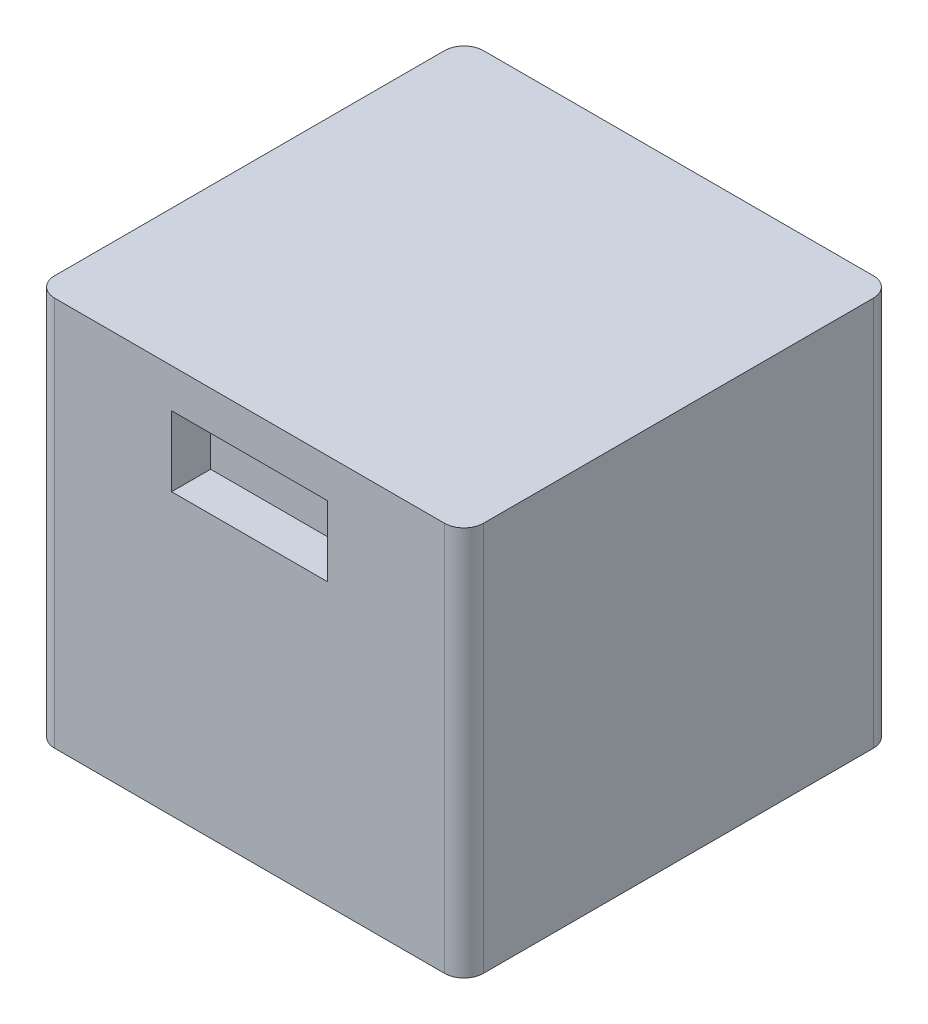
ISO-10303-21;
HEADER;
FILE_DESCRIPTION(('STEP AP214'),'2;1');
FILE_NAME('part.step','',(''),(''),'','','');
FILE_SCHEMA(('AUTOMOTIVE_DESIGN { 1 0 10303 214 1 1 1 1 }'));
ENDSEC;
DATA;
#1=APPLICATION_CONTEXT('core data for automotive mechanical design processes');
#2=APPLICATION_PROTOCOL_DEFINITION('international standard','automotive_design',2000,#1);
#3=PRODUCT_CONTEXT('',#1,'mechanical');
#4=PRODUCT('Part','Part','',(#3));
#5=PRODUCT_RELATED_PRODUCT_CATEGORY('part','',(#4));
#6=PRODUCT_DEFINITION_FORMATION('','',#4);
#7=PRODUCT_DEFINITION_CONTEXT('part definition',#1,'design');
#8=PRODUCT_DEFINITION('design','',#6,#7);
#9=PRODUCT_DEFINITION_SHAPE('','',#8);
#10=(LENGTH_UNIT() NAMED_UNIT(*) SI_UNIT(.MILLI.,.METRE.));
#11=(NAMED_UNIT(*) PLANE_ANGLE_UNIT() SI_UNIT($,.RADIAN.));
#12=(NAMED_UNIT(*) SI_UNIT($,.STERADIAN.) SOLID_ANGLE_UNIT());
#13=UNCERTAINTY_MEASURE_WITH_UNIT(LENGTH_MEASURE(1.E-05),#10,'distance_accuracy_value','');
#14=(GEOMETRIC_REPRESENTATION_CONTEXT(3) GLOBAL_UNCERTAINTY_ASSIGNED_CONTEXT((#13)) GLOBAL_UNIT_ASSIGNED_CONTEXT((#10,
#11,#12)) REPRESENTATION_CONTEXT('',''));
#15=CARTESIAN_POINT('',(0.,0.,0.));
#16=DIRECTION('',(0.,0.,1.));
#17=DIRECTION('',(1.,0.,0.));
#18=AXIS2_PLACEMENT_3D('',#15,#16,#17);
#19=CARTESIAN_POINT('',(110.,200.,-110.));
#20=DIRECTION('',(-1.,0.,0.));
#21=DIRECTION('',(0.,0.,1.));
#22=AXIS2_PLACEMENT_3D('',#19,#20,#21);
#23=PLANE('',#22);
#24=DIRECTION('',(0.,0.,-1.));
#25=VECTOR('',#24,1.);
#26=CARTESIAN_POINT('',(110.,0.,-110.));
#27=LINE('',#26,#25);
#28=CARTESIAN_POINT('',(110.,0.,100.));
#29=VERTEX_POINT('',#28);
#30=CARTESIAN_POINT('',(110.,0.,-100.));
#31=VERTEX_POINT('',#30);
#32=EDGE_CURVE('E255',#29,#31,#27,.T.);
#33=ORIENTED_EDGE('',*,*,#32,.T.);
#34=DIRECTION('',(0.,-1.,0.));
#35=VECTOR('',#34,1.);
#36=CARTESIAN_POINT('',(110.,200.,-100.));
#37=LINE('',#36,#35);
#38=CARTESIAN_POINT('',(110.,200.,-100.));
#39=VERTEX_POINT('',#38);
#40=EDGE_CURVE('E340',#31,#39,#37,.F.);
#41=ORIENTED_EDGE('',*,*,#40,.T.);
#42=DIRECTION('',(0.,0.,-1.));
#43=VECTOR('',#42,1.);
#44=CARTESIAN_POINT('',(110.,200.,-110.));
#45=LINE('',#44,#43);
#46=CARTESIAN_POINT('',(110.,200.,100.));
#47=VERTEX_POINT('',#46);
#48=EDGE_CURVE('E267',#47,#39,#45,.T.);
#49=ORIENTED_EDGE('',*,*,#48,.F.);
#50=DIRECTION('',(0.,-1.,0.));
#51=VECTOR('',#50,1.);
#52=CARTESIAN_POINT('',(110.,200.,100.));
#53=LINE('',#52,#51);
#54=EDGE_CURVE('E336',#47,#29,#53,.T.);
#55=ORIENTED_EDGE('',*,*,#54,.T.);
#56=EDGE_LOOP('',(#33,#41,#49,#55));
#57=FACE_BOUND('',#56,.T.);
#58=ADVANCED_FACE('F45',(#57),#23,.F.);
#59=CARTESIAN_POINT('',(-110.,200.,-110.));
#60=DIRECTION('',(0.,0.,1.));
#61=DIRECTION('',(1.,0.,0.));
#62=AXIS2_PLACEMENT_3D('',#59,#60,#61);
#63=PLANE('',#62);
#64=DIRECTION('',(-1.,0.,0.));
#65=VECTOR('',#64,1.);
#66=CARTESIAN_POINT('',(-110.,0.,-110.));
#67=LINE('',#66,#65);
#68=CARTESIAN_POINT('',(100.,0.,-110.));
#69=VERTEX_POINT('',#68);
#70=CARTESIAN_POINT('',(-100.,0.,-110.));
#71=VERTEX_POINT('',#70);
#72=EDGE_CURVE('E288',#69,#71,#67,.T.);
#73=ORIENTED_EDGE('',*,*,#72,.T.);
#74=DIRECTION('',(0.,-1.,0.));
#75=VECTOR('',#74,1.);
#76=CARTESIAN_POINT('',(-100.,200.,-110.));
#77=LINE('',#76,#75);
#78=CARTESIAN_POINT('',(-100.,200.,-110.));
#79=VERTEX_POINT('',#78);
#80=EDGE_CURVE('E321',#71,#79,#77,.F.);
#81=ORIENTED_EDGE('',*,*,#80,.T.);
#82=DIRECTION('',(-1.,0.,0.));
#83=VECTOR('',#82,1.);
#84=CARTESIAN_POINT('',(-110.,200.,-110.));
#85=LINE('',#84,#83);
#86=CARTESIAN_POINT('',(100.,200.,-110.));
#87=VERTEX_POINT('',#86);
#88=EDGE_CURVE('E271',#87,#79,#85,.T.);
#89=ORIENTED_EDGE('',*,*,#88,.F.);
#90=DIRECTION('',(0.,-1.,0.));
#91=VECTOR('',#90,1.);
#92=CARTESIAN_POINT('',(100.,200.,-110.));
#93=LINE('',#92,#91);
#94=EDGE_CURVE('E317',#87,#69,#93,.T.);
#95=ORIENTED_EDGE('',*,*,#94,.T.);
#96=EDGE_LOOP('',(#73,#81,#89,#95));
#97=FACE_BOUND('',#96,.T.);
#98=ADVANCED_FACE('F372',(#97),#63,.F.);
#99=CARTESIAN_POINT('',(-110.,200.,-110.));
#100=DIRECTION('',(1.,0.,0.));
#101=DIRECTION('',(0.,0.,-1.));
#102=AXIS2_PLACEMENT_3D('',#99,#100,#101);
#103=PLANE('',#102);
#104=DIRECTION('',(0.,0.,1.));
#105=VECTOR('',#104,1.);
#106=CARTESIAN_POINT('',(-110.,200.,-110.));
#107=LINE('',#106,#105);
#108=CARTESIAN_POINT('',(-110.,200.,-100.));
#109=VERTEX_POINT('',#108);
#110=CARTESIAN_POINT('',(-110.,200.,100.));
#111=VERTEX_POINT('',#110);
#112=EDGE_CURVE('E276',#109,#111,#107,.T.);
#113=ORIENTED_EDGE('',*,*,#112,.F.);
#114=DIRECTION('',(0.,-1.,0.));
#115=VECTOR('',#114,1.);
#116=CARTESIAN_POINT('',(-110.,200.,-100.));
#117=LINE('',#116,#115);
#118=CARTESIAN_POINT('',(-110.,0.,-100.));
#119=VERTEX_POINT('',#118);
#120=EDGE_CURVE('E301',#109,#119,#117,.T.);
#121=ORIENTED_EDGE('',*,*,#120,.T.);
#122=DIRECTION('',(0.,0.,1.));
#123=VECTOR('',#122,1.);
#124=CARTESIAN_POINT('',(-110.,0.,-110.));
#125=LINE('',#124,#123);
#126=CARTESIAN_POINT('',(-110.,0.,100.));
#127=VERTEX_POINT('',#126);
#128=EDGE_CURVE('E292',#119,#127,#125,.T.);
#129=ORIENTED_EDGE('',*,*,#128,.T.);
#130=DIRECTION('',(0.,-1.,0.));
#131=VECTOR('',#130,1.);
#132=CARTESIAN_POINT('',(-110.,200.,100.));
#133=LINE('',#132,#131);
#134=EDGE_CURVE('E284',#127,#111,#133,.F.);
#135=ORIENTED_EDGE('',*,*,#134,.T.);
#136=EDGE_LOOP('',(#113,#121,#129,#135));
#137=FACE_BOUND('',#136,.T.);
#138=ADVANCED_FACE('F380',(#137),#103,.F.);
#139=CARTESIAN_POINT('',(-110.,200.,110.));
#140=DIRECTION('',(0.,0.,-1.));
#141=DIRECTION('',(-1.,0.,0.));
#142=AXIS2_PLACEMENT_3D('',#139,#140,#141);
#143=PLANE('',#142);
#144=DIRECTION('',(-1.,0.,0.));
#145=VECTOR('',#144,1.);
#146=CARTESIAN_POINT('',(-40.,180.,110.));
#147=LINE('',#146,#145);
#148=CARTESIAN_POINT('',(40.,180.,110.));
#149=VERTEX_POINT('',#148);
#150=CARTESIAN_POINT('',(-40.,180.,110.));
#151=VERTEX_POINT('',#150);
#152=EDGE_CURVE('E228',#149,#151,#147,.T.);
#153=ORIENTED_EDGE('',*,*,#152,.F.);
#154=DIRECTION('',(0.,1.,0.));
#155=VECTOR('',#154,1.);
#156=CARTESIAN_POINT('',(40.,180.,110.));
#157=LINE('',#156,#155);
#158=CARTESIAN_POINT('',(40.,144.,110.));
#159=VERTEX_POINT('',#158);
#160=EDGE_CURVE('E69',#159,#149,#157,.T.);
#161=ORIENTED_EDGE('',*,*,#160,.F.);
#162=DIRECTION('',(1.,0.,0.));
#163=VECTOR('',#162,1.);
#164=CARTESIAN_POINT('',(-40.,144.,110.));
#165=LINE('',#164,#163);
#166=CARTESIAN_POINT('',(-40.,144.,110.));
#167=VERTEX_POINT('',#166);
#168=EDGE_CURVE('E213',#167,#159,#165,.T.);
#169=ORIENTED_EDGE('',*,*,#168,.F.);
#170=DIRECTION('',(0.,-1.,0.));
#171=VECTOR('',#170,1.);
#172=CARTESIAN_POINT('',(-40.,180.,110.));
#173=LINE('',#172,#171);
#174=EDGE_CURVE('E232',#151,#167,#173,.T.);
#175=ORIENTED_EDGE('',*,*,#174,.F.);
#176=EDGE_LOOP('',(#153,#161,#169,#175));
#177=FACE_BOUND('',#176,.T.);
#178=DIRECTION('',(1.,0.,0.));
#179=VECTOR('',#178,1.);
#180=CARTESIAN_POINT('',(-110.,0.,110.));
#181=LINE('',#180,#179);
#182=CARTESIAN_POINT('',(-100.,0.,110.));
#183=VERTEX_POINT('',#182);
#184=CARTESIAN_POINT('',(100.,0.,110.));
#185=VERTEX_POINT('',#184);
#186=EDGE_CURVE('E272',#183,#185,#181,.T.);
#187=ORIENTED_EDGE('',*,*,#186,.T.);
#188=DIRECTION('',(0.,-1.,0.));
#189=VECTOR('',#188,1.);
#190=CARTESIAN_POINT('',(100.,200.,110.));
#191=LINE('',#190,#189);
#192=CARTESIAN_POINT('',(100.,200.,110.));
#193=VERTEX_POINT('',#192);
#194=EDGE_CURVE('E11',#185,#193,#191,.F.);
#195=ORIENTED_EDGE('',*,*,#194,.T.);
#196=DIRECTION('',(1.,0.,0.));
#197=VECTOR('',#196,1.);
#198=CARTESIAN_POINT('',(-110.,200.,110.));
#199=LINE('',#198,#197);
#200=CARTESIAN_POINT('',(-100.,200.,110.));
#201=VERTEX_POINT('',#200);
#202=EDGE_CURVE('E280',#201,#193,#199,.T.);
#203=ORIENTED_EDGE('',*,*,#202,.F.);
#204=DIRECTION('',(0.,-1.,0.));
#205=VECTOR('',#204,1.);
#206=CARTESIAN_POINT('',(-100.,200.,110.));
#207=LINE('',#206,#205);
#208=EDGE_CURVE('E54',#201,#183,#207,.T.);
#209=ORIENTED_EDGE('',*,*,#208,.T.);
#210=EDGE_LOOP('',(#187,#195,#203,#209));
#211=FACE_BOUND('',#210,.T.);
#212=ADVANCED_FACE('F348',(#177,#211),#143,.F.);
#213=CARTESIAN_POINT('',(0.,200.,0.));
#214=DIRECTION('',(0.,1.,0.));
#215=DIRECTION('',(0.,0.,1.));
#216=AXIS2_PLACEMENT_3D('',#213,#214,#215);
#217=PLANE('',#216);
#218=ORIENTED_EDGE('',*,*,#88,.T.);
#219=CARTESIAN_POINT('',(-100.,200.,-100.));
#220=DIRECTION('',(0.,1.,0.));
#221=DIRECTION('',(0.,0.,1.));
#222=AXIS2_PLACEMENT_3D('',#219,#220,#221);
#223=CIRCLE('',#222,10.);
#224=EDGE_CURVE('E333',#79,#109,#223,.T.);
#225=ORIENTED_EDGE('',*,*,#224,.T.);
#226=ORIENTED_EDGE('',*,*,#112,.T.);
#227=CARTESIAN_POINT('',(-100.,200.,100.));
#228=DIRECTION('',(0.,1.,0.));
#229=DIRECTION('',(0.,0.,1.));
#230=AXIS2_PLACEMENT_3D('',#227,#228,#229);
#231=CIRCLE('',#230,10.);
#232=EDGE_CURVE('E324',#111,#201,#231,.T.);
#233=ORIENTED_EDGE('',*,*,#232,.T.);
#234=ORIENTED_EDGE('',*,*,#202,.T.);
#235=CARTESIAN_POINT('',(100.,200.,100.));
#236=DIRECTION('',(0.,1.,0.));
#237=DIRECTION('',(0.,0.,1.));
#238=AXIS2_PLACEMENT_3D('',#235,#236,#237);
#239=CIRCLE('',#238,10.);
#240=EDGE_CURVE('E327',#193,#47,#239,.T.);
#241=ORIENTED_EDGE('',*,*,#240,.T.);
#242=ORIENTED_EDGE('',*,*,#48,.T.);
#243=CARTESIAN_POINT('',(100.,200.,-100.));
#244=DIRECTION('',(0.,1.,0.));
#245=DIRECTION('',(0.,0.,1.));
#246=AXIS2_PLACEMENT_3D('',#243,#244,#245);
#247=CIRCLE('',#246,10.);
#248=EDGE_CURVE('E330',#39,#87,#247,.T.);
#249=ORIENTED_EDGE('',*,*,#248,.T.);
#250=EDGE_LOOP('',(#218,#225,#226,#233,#234,#241,#242,#249));
#251=FACE_BOUND('',#250,.T.);
#252=ADVANCED_FACE('F365',(#251),#217,.T.);
#253=CARTESIAN_POINT('',(0.,0.,0.));
#254=DIRECTION('',(0.,1.,0.));
#255=DIRECTION('',(0.,0.,1.));
#256=AXIS2_PLACEMENT_3D('',#253,#254,#255);
#257=PLANE('',#256);
#258=CARTESIAN_POINT('',(0.,0.,-50.));
#259=DIRECTION('',(0.,-1.,0.));
#260=DIRECTION('',(0.,0.,-1.));
#261=AXIS2_PLACEMENT_3D('',#258,#259,#260);
#262=CIRCLE('',#261,30.);
#263=CARTESIAN_POINT('',(0.,0.,-80.));
#264=VERTEX_POINT('',#263);
#265=EDGE_CURVE('E256',#264,#264,#262,.T.);
#266=ORIENTED_EDGE('',*,*,#265,.F.);
#267=EDGE_LOOP('',(#266));
#268=FACE_BOUND('',#267,.T.);
#269=CARTESIAN_POINT('',(0.,0.,60.));
#270=DIRECTION('',(0.,-1.,0.));
#271=DIRECTION('',(0.,0.,-1.));
#272=AXIS2_PLACEMENT_3D('',#269,#270,#271);
#273=CIRCLE('',#272,30.);
#274=CARTESIAN_POINT('',(0.,0.,30.));
#275=VERTEX_POINT('',#274);
#276=EDGE_CURVE('E260',#275,#275,#273,.T.);
#277=ORIENTED_EDGE('',*,*,#276,.F.);
#278=EDGE_LOOP('',(#277));
#279=FACE_BOUND('',#278,.T.);
#280=ORIENTED_EDGE('',*,*,#128,.F.);
#281=CARTESIAN_POINT('',(-100.,0.,-100.));
#282=DIRECTION('',(0.,1.,0.));
#283=DIRECTION('',(0.,0.,1.));
#284=AXIS2_PLACEMENT_3D('',#281,#282,#283);
#285=CIRCLE('',#284,10.);
#286=EDGE_CURVE('E314',#119,#71,#285,.F.);
#287=ORIENTED_EDGE('',*,*,#286,.T.);
#288=ORIENTED_EDGE('',*,*,#72,.F.);
#289=CARTESIAN_POINT('',(100.,0.,-100.));
#290=DIRECTION('',(0.,1.,0.));
#291=DIRECTION('',(0.,0.,1.));
#292=AXIS2_PLACEMENT_3D('',#289,#290,#291);
#293=CIRCLE('',#292,10.);
#294=EDGE_CURVE('E311',#69,#31,#293,.F.);
#295=ORIENTED_EDGE('',*,*,#294,.T.);
#296=ORIENTED_EDGE('',*,*,#32,.F.);
#297=CARTESIAN_POINT('',(100.,0.,100.));
#298=DIRECTION('',(0.,1.,0.));
#299=DIRECTION('',(0.,0.,1.));
#300=AXIS2_PLACEMENT_3D('',#297,#298,#299);
#301=CIRCLE('',#300,10.);
#302=EDGE_CURVE('E308',#29,#185,#301,.F.);
#303=ORIENTED_EDGE('',*,*,#302,.T.);
#304=ORIENTED_EDGE('',*,*,#186,.F.);
#305=CARTESIAN_POINT('',(-100.,0.,100.));
#306=DIRECTION('',(0.,1.,0.));
#307=DIRECTION('',(0.,0.,1.));
#308=AXIS2_PLACEMENT_3D('',#305,#306,#307);
#309=CIRCLE('',#308,10.);
#310=EDGE_CURVE('E305',#183,#127,#309,.F.);
#311=ORIENTED_EDGE('',*,*,#310,.T.);
#312=EDGE_LOOP('',(#280,#287,#288,#295,#296,#303,#304,#311));
#313=FACE_BOUND('',#312,.T.);
#314=ADVANCED_FACE('F354',(#268,#279,#313),#257,.F.);
#315=CARTESIAN_POINT('',(-100.,200.,-100.));
#316=DIRECTION('',(0.,-1.,0.));
#317=DIRECTION('',(0.,0.,-1.));
#318=AXIS2_PLACEMENT_3D('',#315,#316,#317);
#319=CYLINDRICAL_SURFACE('',#318,10.);
#320=ORIENTED_EDGE('',*,*,#224,.F.);
#321=ORIENTED_EDGE('',*,*,#80,.F.);
#322=ORIENTED_EDGE('',*,*,#286,.F.);
#323=ORIENTED_EDGE('',*,*,#120,.F.);
#324=EDGE_LOOP('',(#320,#321,#322,#323));
#325=FACE_BOUND('',#324,.T.);
#326=ADVANCED_FACE('F377',(#325),#319,.T.);
#327=CARTESIAN_POINT('',(100.,200.,-100.));
#328=DIRECTION('',(0.,-1.,0.));
#329=DIRECTION('',(0.,0.,-1.));
#330=AXIS2_PLACEMENT_3D('',#327,#328,#329);
#331=CYLINDRICAL_SURFACE('',#330,10.);
#332=ORIENTED_EDGE('',*,*,#248,.F.);
#333=ORIENTED_EDGE('',*,*,#40,.F.);
#334=ORIENTED_EDGE('',*,*,#294,.F.);
#335=ORIENTED_EDGE('',*,*,#94,.F.);
#336=EDGE_LOOP('',(#332,#333,#334,#335));
#337=FACE_BOUND('',#336,.T.);
#338=ADVANCED_FACE('F369',(#337),#331,.T.);
#339=CARTESIAN_POINT('',(100.,200.,100.));
#340=DIRECTION('',(0.,-1.,0.));
#341=DIRECTION('',(0.,0.,-1.));
#342=AXIS2_PLACEMENT_3D('',#339,#340,#341);
#343=CYLINDRICAL_SURFACE('',#342,10.);
#344=ORIENTED_EDGE('',*,*,#240,.F.);
#345=ORIENTED_EDGE('',*,*,#194,.F.);
#346=ORIENTED_EDGE('',*,*,#302,.F.);
#347=ORIENTED_EDGE('',*,*,#54,.F.);
#348=EDGE_LOOP('',(#344,#345,#346,#347));
#349=FACE_BOUND('',#348,.T.);
#350=ADVANCED_FACE('F359',(#349),#343,.T.);
#351=CARTESIAN_POINT('',(-100.,200.,100.));
#352=DIRECTION('',(0.,-1.,0.));
#353=DIRECTION('',(0.,0.,-1.));
#354=AXIS2_PLACEMENT_3D('',#351,#352,#353);
#355=CYLINDRICAL_SURFACE('',#354,10.);
#356=ORIENTED_EDGE('',*,*,#232,.F.);
#357=ORIENTED_EDGE('',*,*,#134,.F.);
#358=ORIENTED_EDGE('',*,*,#310,.F.);
#359=ORIENTED_EDGE('',*,*,#208,.F.);
#360=EDGE_LOOP('',(#356,#357,#358,#359));
#361=FACE_BOUND('',#360,.T.);
#362=ADVANCED_FACE('F47',(#361),#355,.T.);
#363=CARTESIAN_POINT('',(0.,20.,60.));
#364=DIRECTION('',(0.,-1.,0.));
#365=DIRECTION('',(0.,0.,-1.));
#366=AXIS2_PLACEMENT_3D('',#363,#364,#365);
#367=CYLINDRICAL_SURFACE('',#366,30.);
#368=CARTESIAN_POINT('',(0.,20.,60.));
#369=DIRECTION('',(0.,-1.,0.));
#370=DIRECTION('',(0.,0.,-1.));
#371=AXIS2_PLACEMENT_3D('',#368,#369,#370);
#372=CIRCLE('',#371,30.);
#373=CARTESIAN_POINT('',(0.,20.,30.));
#374=VERTEX_POINT('',#373);
#375=EDGE_CURVE('E242',#374,#374,#372,.T.);
#376=ORIENTED_EDGE('',*,*,#375,.F.);
#377=EDGE_LOOP('',(#376));
#378=FACE_BOUND('',#377,.T.);
#379=ORIENTED_EDGE('',*,*,#276,.T.);
#380=EDGE_LOOP('',(#379));
#381=FACE_BOUND('',#380,.T.);
#382=ADVANCED_FACE('F383',(#378,#381),#367,.F.);
#383=CARTESIAN_POINT('',(0.,20.,60.));
#384=DIRECTION('',(0.,-1.,0.));
#385=DIRECTION('',(0.,0.,-1.));
#386=AXIS2_PLACEMENT_3D('',#383,#384,#385);
#387=PLANE('',#386);
#388=ORIENTED_EDGE('',*,*,#375,.T.);
#389=EDGE_LOOP('',(#388));
#390=FACE_BOUND('',#389,.T.);
#391=ADVANCED_FACE('F388',(#390),#387,.T.);
#392=CARTESIAN_POINT('',(0.,20.,-50.));
#393=DIRECTION('',(0.,-1.,0.));
#394=DIRECTION('',(0.,0.,-1.));
#395=AXIS2_PLACEMENT_3D('',#392,#393,#394);
#396=CYLINDRICAL_SURFACE('',#395,30.);
#397=CARTESIAN_POINT('',(0.,20.,-50.));
#398=DIRECTION('',(0.,-1.,0.));
#399=DIRECTION('',(0.,0.,-1.));
#400=AXIS2_PLACEMENT_3D('',#397,#398,#399);
#401=CIRCLE('',#400,30.);
#402=CARTESIAN_POINT('',(0.,20.,-80.));
#403=VERTEX_POINT('',#402);
#404=EDGE_CURVE('E251',#403,#403,#401,.T.);
#405=ORIENTED_EDGE('',*,*,#404,.F.);
#406=EDGE_LOOP('',(#405));
#407=FACE_BOUND('',#406,.T.);
#408=ORIENTED_EDGE('',*,*,#265,.T.);
#409=EDGE_LOOP('',(#408));
#410=FACE_BOUND('',#409,.T.);
#411=ADVANCED_FACE('F445',(#407,#410),#396,.F.);
#412=CARTESIAN_POINT('',(0.,20.,-50.));
#413=DIRECTION('',(0.,-1.,0.));
#414=DIRECTION('',(0.,0.,-1.));
#415=AXIS2_PLACEMENT_3D('',#412,#413,#414);
#416=PLANE('',#415);
#417=ORIENTED_EDGE('',*,*,#404,.T.);
#418=EDGE_LOOP('',(#417));
#419=FACE_BOUND('',#418,.T.);
#420=ADVANCED_FACE('F456',(#419),#416,.T.);
#421=CARTESIAN_POINT('',(40.,180.,90.));
#422=DIRECTION('',(1.,0.,0.));
#423=DIRECTION('',(0.,1.,0.));
#424=AXIS2_PLACEMENT_3D('',#421,#422,#423);
#425=PLANE('',#424);
#426=DIRECTION('',(0.,0.,-1.));
#427=VECTOR('',#426,1.);
#428=CARTESIAN_POINT('',(40.,175.987181080042,93.4043763371493));
#429=LINE('',#428,#427);
#430=CARTESIAN_POINT('',(40.,175.987181080042,106.595623662851));
#431=VERTEX_POINT('',#430);
#432=CARTESIAN_POINT('',(40.,175.987181080042,93.4043763371493));
#433=VERTEX_POINT('',#432);
#434=EDGE_CURVE('E194',#431,#433,#429,.T.);
#435=ORIENTED_EDGE('',*,*,#434,.F.);
#436=DIRECTION('',(0.,1.,0.));
#437=VECTOR('',#436,1.);
#438=CARTESIAN_POINT('',(40.,175.987181080042,106.595623662851));
#439=LINE('',#438,#437);
#440=CARTESIAN_POINT('',(40.,152.421806815114,106.595623662851));
#441=VERTEX_POINT('',#440);
#442=EDGE_CURVE('E61',#441,#431,#439,.T.);
#443=ORIENTED_EDGE('',*,*,#442,.F.);
#444=DIRECTION('',(0.,0.,1.));
#445=VECTOR('',#444,1.);
#446=CARTESIAN_POINT('',(40.,152.421806815114,93.4043763371493));
#447=LINE('',#446,#445);
#448=CARTESIAN_POINT('',(40.,152.421806815114,93.4043763371493));
#449=VERTEX_POINT('',#448);
#450=EDGE_CURVE('E181',#449,#441,#447,.T.);
#451=ORIENTED_EDGE('',*,*,#450,.F.);
#452=DIRECTION('',(0.,-1.,0.));
#453=VECTOR('',#452,1.);
#454=CARTESIAN_POINT('',(40.,175.987181080042,93.4043763371493));
#455=LINE('',#454,#453);
#456=EDGE_CURVE('E185',#433,#449,#455,.T.);
#457=ORIENTED_EDGE('',*,*,#456,.F.);
#458=EDGE_LOOP('',(#435,#443,#451,#457));
#459=FACE_BOUND('',#458,.T.);
#460=ORIENTED_EDGE('',*,*,#160,.T.);
#461=DIRECTION('',(0.,0.,1.));
#462=VECTOR('',#461,1.);
#463=CARTESIAN_POINT('',(40.,180.,90.));
#464=LINE('',#463,#462);
#465=CARTESIAN_POINT('',(40.,180.,90.));
#466=VERTEX_POINT('',#465);
#467=EDGE_CURVE('E225',#466,#149,#464,.T.);
#468=ORIENTED_EDGE('',*,*,#467,.F.);
#469=DIRECTION('',(0.,1.,0.));
#470=VECTOR('',#469,1.);
#471=CARTESIAN_POINT('',(40.,180.,90.));
#472=LINE('',#471,#470);
#473=CARTESIAN_POINT('',(40.,144.,90.));
#474=VERTEX_POINT('',#473);
#475=EDGE_CURVE('E208',#474,#466,#472,.T.);
#476=ORIENTED_EDGE('',*,*,#475,.F.);
#477=DIRECTION('',(0.,0.,1.));
#478=VECTOR('',#477,1.);
#479=CARTESIAN_POINT('',(40.,144.,90.));
#480=LINE('',#479,#478);
#481=EDGE_CURVE('E239',#474,#159,#480,.T.);
#482=ORIENTED_EDGE('',*,*,#481,.T.);
#483=EDGE_LOOP('',(#460,#468,#476,#482));
#484=FACE_BOUND('',#483,.T.);
#485=ADVANCED_FACE('F467',(#459,#484),#425,.F.);
#486=CARTESIAN_POINT('',(-40.,144.,90.));
#487=DIRECTION('',(0.,-1.,0.));
#488=DIRECTION('',(0.,0.,-1.));
#489=AXIS2_PLACEMENT_3D('',#486,#487,#488);
#490=PLANE('',#489);
#491=ORIENTED_EDGE('',*,*,#168,.T.);
#492=ORIENTED_EDGE('',*,*,#481,.F.);
#493=DIRECTION('',(1.,0.,0.));
#494=VECTOR('',#493,1.);
#495=CARTESIAN_POINT('',(-40.,144.,90.));
#496=LINE('',#495,#494);
#497=CARTESIAN_POINT('',(-40.,144.,90.));
#498=VERTEX_POINT('',#497);
#499=EDGE_CURVE('E221',#498,#474,#496,.T.);
#500=ORIENTED_EDGE('',*,*,#499,.F.);
#501=DIRECTION('',(0.,0.,1.));
#502=VECTOR('',#501,1.);
#503=CARTESIAN_POINT('',(-40.,144.,90.));
#504=LINE('',#503,#502);
#505=EDGE_CURVE('E243',#498,#167,#504,.T.);
#506=ORIENTED_EDGE('',*,*,#505,.T.);
#507=EDGE_LOOP('',(#491,#492,#500,#506));
#508=FACE_BOUND('',#507,.T.);
#509=ADVANCED_FACE('F488',(#508),#490,.F.);
#510=CARTESIAN_POINT('',(-40.,180.,90.));
#511=DIRECTION('',(-1.,0.,0.));
#512=DIRECTION('',(0.,0.,1.));
#513=AXIS2_PLACEMENT_3D('',#510,#511,#512);
#514=PLANE('',#513);
#515=ORIENTED_EDGE('',*,*,#174,.T.);
#516=ORIENTED_EDGE('',*,*,#505,.F.);
#517=DIRECTION('',(0.,-1.,0.));
#518=VECTOR('',#517,1.);
#519=CARTESIAN_POINT('',(-40.,180.,90.));
#520=LINE('',#519,#518);
#521=CARTESIAN_POINT('',(-40.,180.,90.));
#522=VERTEX_POINT('',#521);
#523=EDGE_CURVE('E217',#522,#498,#520,.T.);
#524=ORIENTED_EDGE('',*,*,#523,.F.);
#525=DIRECTION('',(0.,0.,1.));
#526=VECTOR('',#525,1.);
#527=CARTESIAN_POINT('',(-40.,180.,90.));
#528=LINE('',#527,#526);
#529=EDGE_CURVE('E246',#522,#151,#528,.T.);
#530=ORIENTED_EDGE('',*,*,#529,.T.);
#531=EDGE_LOOP('',(#515,#516,#524,#530));
#532=FACE_BOUND('',#531,.T.);
#533=ADVANCED_FACE('F493',(#532),#514,.F.);
#534=CARTESIAN_POINT('',(-40.,180.,90.));
#535=DIRECTION('',(0.,1.,0.));
#536=DIRECTION('',(0.,0.,1.));
#537=AXIS2_PLACEMENT_3D('',#534,#535,#536);
#538=PLANE('',#537);
#539=ORIENTED_EDGE('',*,*,#152,.T.);
#540=ORIENTED_EDGE('',*,*,#529,.F.);
#541=DIRECTION('',(-1.,0.,0.));
#542=VECTOR('',#541,1.);
#543=CARTESIAN_POINT('',(-40.,180.,90.));
#544=LINE('',#543,#542);
#545=EDGE_CURVE('E212',#466,#522,#544,.T.);
#546=ORIENTED_EDGE('',*,*,#545,.F.);
#547=ORIENTED_EDGE('',*,*,#467,.T.);
#548=EDGE_LOOP('',(#539,#540,#546,#547));
#549=FACE_BOUND('',#548,.T.);
#550=ADVANCED_FACE('F504',(#549),#538,.F.);
#551=CARTESIAN_POINT('',(0.,0.,90.));
#552=DIRECTION('',(0.,0.,1.));
#553=DIRECTION('',(1.,0.,0.));
#554=AXIS2_PLACEMENT_3D('',#551,#552,#553);
#555=PLANE('',#554);
#556=ORIENTED_EDGE('',*,*,#475,.T.);
#557=ORIENTED_EDGE('',*,*,#545,.T.);
#558=ORIENTED_EDGE('',*,*,#523,.T.);
#559=ORIENTED_EDGE('',*,*,#499,.T.);
#560=EDGE_LOOP('',(#556,#557,#558,#559));
#561=FACE_BOUND('',#560,.T.);
#562=ADVANCED_FACE('F515',(#561),#555,.T.);
#563=CARTESIAN_POINT('',(50.,175.987181080042,106.595623662851));
#564=DIRECTION('',(0.,0.,1.));
#565=DIRECTION('',(1.,0.,0.));
#566=AXIS2_PLACEMENT_3D('',#563,#564,#565);
#567=PLANE('',#566);
#568=ORIENTED_EDGE('',*,*,#442,.T.);
#569=DIRECTION('',(-1.,0.,0.));
#570=VECTOR('',#569,1.);
#571=CARTESIAN_POINT('',(50.,175.987181080042,106.595623662851));
#572=LINE('',#571,#570);
#573=CARTESIAN_POINT('',(50.,175.987181080042,106.595623662851));
#574=VERTEX_POINT('',#573);
#575=EDGE_CURVE('E156',#574,#431,#572,.T.);
#576=ORIENTED_EDGE('',*,*,#575,.F.);
#577=DIRECTION('',(0.,1.,0.));
#578=VECTOR('',#577,1.);
#579=CARTESIAN_POINT('',(50.,175.987181080042,106.595623662851));
#580=LINE('',#579,#578);
#581=CARTESIAN_POINT('',(50.,152.421806815114,106.595623662851));
#582=VERTEX_POINT('',#581);
#583=EDGE_CURVE('E160',#582,#574,#580,.T.);
#584=ORIENTED_EDGE('',*,*,#583,.F.);
#585=DIRECTION('',(-1.,0.,0.));
#586=VECTOR('',#585,1.);
#587=CARTESIAN_POINT('',(50.,152.421806815114,106.595623662851));
#588=LINE('',#587,#586);
#589=EDGE_CURVE('E200',#582,#441,#588,.T.);
#590=ORIENTED_EDGE('',*,*,#589,.T.);
#591=EDGE_LOOP('',(#568,#576,#584,#590));
#592=FACE_BOUND('',#591,.T.);
#593=ADVANCED_FACE('F158',(#592),#567,.F.);
#594=CARTESIAN_POINT('',(50.,152.421806815114,93.4043763371493));
#595=DIRECTION('',(0.,-1.,0.));
#596=DIRECTION('',(1.,0.,0.));
#597=AXIS2_PLACEMENT_3D('',#594,#595,#596);
#598=PLANE('',#597);
#599=ORIENTED_EDGE('',*,*,#450,.T.);
#600=ORIENTED_EDGE('',*,*,#589,.F.);
#601=DIRECTION('',(0.,0.,1.));
#602=VECTOR('',#601,1.);
#603=CARTESIAN_POINT('',(50.,152.421806815114,93.4043763371493));
#604=LINE('',#603,#602);
#605=CARTESIAN_POINT('',(50.,152.421806815114,93.4043763371493));
#606=VERTEX_POINT('',#605);
#607=EDGE_CURVE('E167',#606,#582,#604,.T.);
#608=ORIENTED_EDGE('',*,*,#607,.F.);
#609=DIRECTION('',(-1.,0.,0.));
#610=VECTOR('',#609,1.);
#611=CARTESIAN_POINT('',(50.,152.421806815114,93.4043763371493));
#612=LINE('',#611,#610);
#613=EDGE_CURVE('E203',#606,#449,#612,.T.);
#614=ORIENTED_EDGE('',*,*,#613,.T.);
#615=EDGE_LOOP('',(#599,#600,#608,#614));
#616=FACE_BOUND('',#615,.T.);
#617=ADVANCED_FACE('F544',(#616),#598,.F.);
#618=CARTESIAN_POINT('',(50.,175.987181080042,93.4043763371493));
#619=DIRECTION('',(0.,0.,-1.));
#620=DIRECTION('',(0.,1.,0.));
#621=AXIS2_PLACEMENT_3D('',#618,#619,#620);
#622=PLANE('',#621);
#623=ORIENTED_EDGE('',*,*,#456,.T.);
#624=ORIENTED_EDGE('',*,*,#613,.F.);
#625=DIRECTION('',(0.,-1.,0.));
#626=VECTOR('',#625,1.);
#627=CARTESIAN_POINT('',(50.,175.987181080042,93.4043763371493));
#628=LINE('',#627,#626);
#629=CARTESIAN_POINT('',(50.,175.987181080042,93.4043763371493));
#630=VERTEX_POINT('',#629);
#631=EDGE_CURVE('E176',#630,#606,#628,.T.);
#632=ORIENTED_EDGE('',*,*,#631,.F.);
#633=DIRECTION('',(-1.,0.,0.));
#634=VECTOR('',#633,1.);
#635=CARTESIAN_POINT('',(50.,175.987181080042,93.4043763371493));
#636=LINE('',#635,#634);
#637=EDGE_CURVE('E166',#630,#433,#636,.T.);
#638=ORIENTED_EDGE('',*,*,#637,.T.);
#639=EDGE_LOOP('',(#623,#624,#632,#638));
#640=FACE_BOUND('',#639,.T.);
#641=ADVANCED_FACE('F554',(#640),#622,.F.);
#642=CARTESIAN_POINT('',(50.,175.987181080042,93.4043763371493));
#643=DIRECTION('',(0.,1.,0.));
#644=DIRECTION('',(-1.,0.,0.));
#645=AXIS2_PLACEMENT_3D('',#642,#643,#644);
#646=PLANE('',#645);
#647=ORIENTED_EDGE('',*,*,#434,.T.);
#648=ORIENTED_EDGE('',*,*,#637,.F.);
#649=DIRECTION('',(0.,0.,-1.));
#650=VECTOR('',#649,1.);
#651=CARTESIAN_POINT('',(50.,175.987181080042,93.4043763371493));
#652=LINE('',#651,#650);
#653=EDGE_CURVE('E170',#574,#630,#652,.T.);
#654=ORIENTED_EDGE('',*,*,#653,.F.);
#655=ORIENTED_EDGE('',*,*,#575,.T.);
#656=EDGE_LOOP('',(#647,#648,#654,#655));
#657=FACE_BOUND('',#656,.T.);
#658=ADVANCED_FACE('F171',(#657),#646,.F.);
#659=CARTESIAN_POINT('',(50.0000000000001,0.,0.));
#660=DIRECTION('',(-1.,0.,0.));
#661=DIRECTION('',(0.,-1.,0.));
#662=AXIS2_PLACEMENT_3D('',#659,#660,#661);
#663=PLANE('',#662);
#664=ORIENTED_EDGE('',*,*,#583,.T.);
#665=ORIENTED_EDGE('',*,*,#653,.T.);
#666=ORIENTED_EDGE('',*,*,#631,.T.);
#667=ORIENTED_EDGE('',*,*,#607,.T.);
#668=EDGE_LOOP('',(#664,#665,#666,#667));
#669=FACE_BOUND('',#668,.T.);
#670=ADVANCED_FACE('F178',(#669),#663,.T.);
#671=CLOSED_SHELL('',(#58,#98,#138,#212,#252,#314,#326,#338,#350,#362,#382,#391,#411,#420,#485,
#509,#533,#550,#562,#593,#617,#641,#658,#670));
#672=MANIFOLD_SOLID_BREP('B2',#671);
#673=ADVANCED_BREP_SHAPE_REPRESENTATION('',(#18,#672),#14);
#674=SHAPE_DEFINITION_REPRESENTATION(#9,#673);
ENDSEC;
END-ISO-10303-21;
